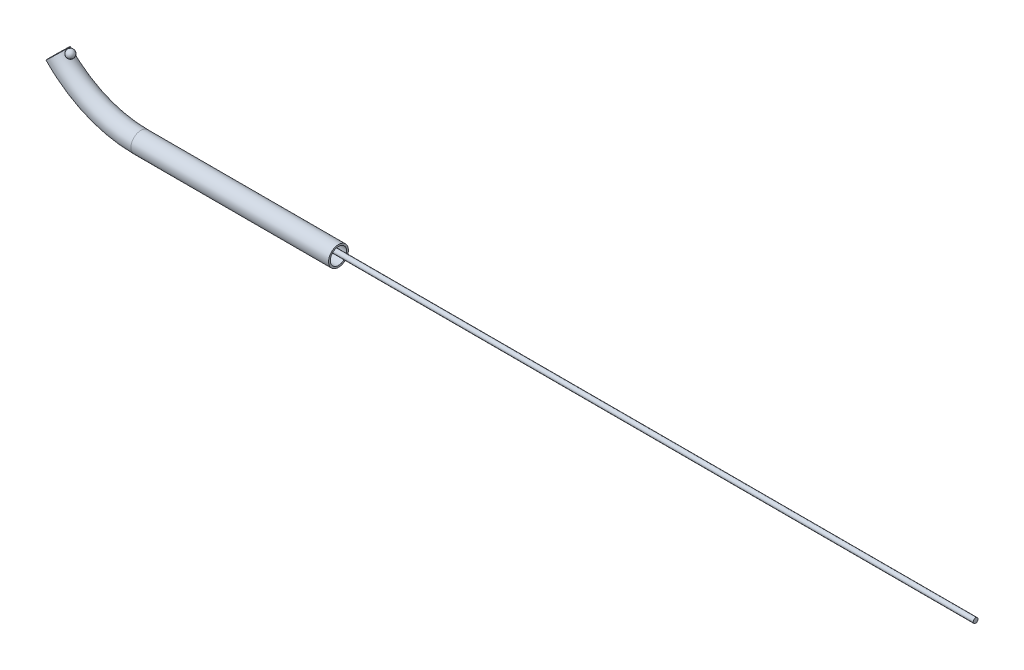
ISO-10303-21;
HEADER;
FILE_DESCRIPTION(('STEP AP214'),'2;1');
FILE_NAME('part.step','',(''),(''),'','','');
FILE_SCHEMA(('AUTOMOTIVE_DESIGN { 1 0 10303 214 1 1 1 1 }'));
ENDSEC;
DATA;
#1=APPLICATION_CONTEXT('core data for automotive mechanical design processes');
#2=APPLICATION_PROTOCOL_DEFINITION('international standard','automotive_design',2000,#1);
#3=PRODUCT_CONTEXT('',#1,'mechanical');
#4=PRODUCT('Part','Part','',(#3));
#5=PRODUCT_RELATED_PRODUCT_CATEGORY('part','',(#4));
#6=PRODUCT_DEFINITION_FORMATION('','',#4);
#7=PRODUCT_DEFINITION_CONTEXT('part definition',#1,'design');
#8=PRODUCT_DEFINITION('design','',#6,#7);
#9=PRODUCT_DEFINITION_SHAPE('','',#8);
#10=(LENGTH_UNIT() NAMED_UNIT(*) SI_UNIT(.MILLI.,.METRE.));
#11=(NAMED_UNIT(*) PLANE_ANGLE_UNIT() SI_UNIT($,.RADIAN.));
#12=(NAMED_UNIT(*) SI_UNIT($,.STERADIAN.) SOLID_ANGLE_UNIT());
#13=UNCERTAINTY_MEASURE_WITH_UNIT(LENGTH_MEASURE(1.E-05),#10,'distance_accuracy_value','');
#14=(GEOMETRIC_REPRESENTATION_CONTEXT(3) GLOBAL_UNCERTAINTY_ASSIGNED_CONTEXT((#13)) GLOBAL_UNIT_ASSIGNED_CONTEXT((#10,
#11,#12)) REPRESENTATION_CONTEXT('',''));
#15=CARTESIAN_POINT('',(0.,0.,0.));
#16=DIRECTION('',(0.,0.,1.));
#17=DIRECTION('',(1.,0.,0.));
#18=AXIS2_PLACEMENT_3D('',#15,#16,#17);
#19=CARTESIAN_POINT('',(-68.3649682129226,0.177699999999989,0.));
#20=DIRECTION('',(1.,0.,0.));
#21=DIRECTION('',(0.,1.,0.));
#22=AXIS2_PLACEMENT_3D('',#19,#20,#21);
#23=CYLINDRICAL_SURFACE('',#22,0.150000000000008);
#24=CARTESIAN_POINT('',(-68.3649682129226,0.177699999999989,0.));
#25=DIRECTION('',(-1.,0.,0.));
#26=DIRECTION('',(0.,-1.,0.));
#27=AXIS2_PLACEMENT_3D('',#24,#25,#26);
#28=CIRCLE('',#27,0.150000000000008);
#29=CARTESIAN_POINT('',(-68.3649682129226,0.0276999999999812,0.));
#30=VERTEX_POINT('',#29);
#31=EDGE_CURVE('E11',#30,#30,#28,.T.);
#32=ORIENTED_EDGE('',*,*,#31,.F.);
#33=EDGE_LOOP('',(#32));
#34=FACE_BOUND('',#33,.T.);
#35=CARTESIAN_POINT('',(-15.9542229508361,0.177700000000038,0.));
#36=DIRECTION('',(1.,0.,0.));
#37=DIRECTION('',(0.,1.,0.));
#38=AXIS2_PLACEMENT_3D('',#35,#36,#37);
#39=CIRCLE('',#38,0.150000000000008);
#40=CARTESIAN_POINT('',(-15.9542229508361,0.327700000000046,0.));
#41=VERTEX_POINT('',#40);
#42=EDGE_CURVE('E49',#41,#41,#39,.T.);
#43=ORIENTED_EDGE('',*,*,#42,.F.);
#44=EDGE_LOOP('',(#43));
#45=FACE_BOUND('',#44,.T.);
#46=ADVANCED_FACE('F39',(#34,#45),#23,.T.);
#47=CARTESIAN_POINT('',(-68.3649682129226,7.15322745789866,0.));
#48=DIRECTION('',(0.,0.,-1.));
#49=DIRECTION('',(-1.,0.,0.));
#50=AXIS2_PLACEMENT_3D('',#47,#48,#49);
#51=TOROIDAL_SURFACE('',#50,6.97552745789867,0.150000000000008);
#52=CARTESIAN_POINT('',(-73.4211282675444,2.34768598810101,0.));
#53=DIRECTION('',(-0.688914422429251,0.724842685393853,0.));
#54=DIRECTION('',(-0.724842685393853,-0.688914422429251,0.));
#55=AXIS2_PLACEMENT_3D('',#52,#53,#54);
#56=CIRCLE('',#55,0.150000000000008);
#57=CARTESIAN_POINT('',(-73.5298546703535,2.24434882473662,0.));
#58=VERTEX_POINT('',#57);
#59=EDGE_CURVE('E45',#58,#58,#56,.T.);
#60=CARTESIAN_POINT('',(-68.3649682129226,7.15322745789866,0.));
#61=DIRECTION('',(0.,0.,-1.));
#62=DIRECTION('',(-1.,0.,0.));
#63=AXIS2_PLACEMENT_3D('',#60,#61,#62);
#64=CIRCLE('',#63,7.12552745789868);
#65=EDGE_CURVE('',#30,#58,#64,.T.);
#66=ORIENTED_EDGE('',*,*,#31,.T.);
#67=ORIENTED_EDGE('',*,*,#59,.F.);
#68=ORIENTED_EDGE('',*,*,#65,.T.);
#69=ORIENTED_EDGE('',*,*,#65,.F.);
#70=EDGE_LOOP('',(#66,#68,#67,#69));
#71=FACE_BOUND('',#70,.T.);
#72=ADVANCED_FACE('F59',(#71),#51,.T.);
#73=CARTESIAN_POINT('',(-73.4211282675444,2.34768598810101,0.));
#74=DIRECTION('',(-0.688914422429251,0.724842685393853,0.));
#75=DIRECTION('',(-0.724842685393853,-0.688914422429251,0.));
#76=AXIS2_PLACEMENT_3D('',#73,#74,#75);
#77=PLANE('',#76);
#78=ORIENTED_EDGE('',*,*,#59,.T.);
#79=EDGE_LOOP('',(#78));
#80=FACE_BOUND('',#79,.T.);
#81=ADVANCED_FACE('F64',(#80),#77,.T.);
#82=CARTESIAN_POINT('',(-15.9542229508361,0.177700000000038,0.));
#83=DIRECTION('',(1.,0.,0.));
#84=DIRECTION('',(0.,1.,0.));
#85=AXIS2_PLACEMENT_3D('',#82,#83,#84);
#86=PLANE('',#85);
#87=ORIENTED_EDGE('',*,*,#42,.T.);
#88=EDGE_LOOP('',(#87));
#89=FACE_BOUND('',#88,.T.);
#90=ADVANCED_FACE('F56',(#89),#86,.T.);
#91=CLOSED_SHELL('',(#46,#72,#81,#90));
#92=MANIFOLD_SOLID_BREP('B2',#91);
#93=CARTESIAN_POINT('',(-68.3649682129226,7.15322745789866,0.));
#94=DIRECTION('',(0.,0.,-1.));
#95=DIRECTION('',(-1.,0.,0.));
#96=AXIS2_PLACEMENT_3D('',#93,#94,#95);
#97=TOROIDAL_SURFACE('',#96,7.15322745789866,0.6223);
#98=CARTESIAN_POINT('',(-72.9296125399738,2.45231556693282,-0.162231624588265));
#99=CARTESIAN_POINT('',(-72.9215501748899,2.44420333768813,-0.162985915621017));
#100=CARTESIAN_POINT('',(-72.9132495705184,2.43623847207314,-0.162846709843409));
#101=CARTESIAN_POINT('',(-72.8963949861295,2.42081537807001,-0.160778709201735));
#102=CARTESIAN_POINT('',(-72.8878408277221,2.41335751915316,-0.158848623959505));
#103=CARTESIAN_POINT('',(-72.8707373660263,2.39911414014025,-0.153191778621824));
#104=CARTESIAN_POINT('',(-72.8621880917451,2.39232970055476,-0.149462185634209));
#105=CARTESIAN_POINT('',(-72.8454360430442,2.37959646254954,-0.140212048773996));
#106=CARTESIAN_POINT('',(-72.8372332315845,2.37364757464263,-0.134691696900749));
#107=CARTESIAN_POINT('',(-72.8218060884418,2.36288393777016,-0.122093918042157));
#108=CARTESIAN_POINT('',(-72.8145597209712,2.35804041634906,-0.115068420488231));
#109=CARTESIAN_POINT('',(-72.8011924504897,2.34938409272325,-0.0994744633301903));
#110=CARTESIAN_POINT('',(-72.7950704932524,2.34557032344803,-0.0909074640869792));
#111=CARTESIAN_POINT('',(-72.7850736501799,2.33948792826428,-0.0736061865020022));
#112=CARTESIAN_POINT('',(-72.781013716827,2.33708589881384,-0.0650260965331795));
#113=CARTESIAN_POINT('',(-72.7743973684886,2.33322303008166,-0.0471086922633796));
#114=CARTESIAN_POINT('',(-72.7718391225746,2.33176104444553,-0.0377723159424036));
#115=CARTESIAN_POINT('',(-72.7686653842543,2.32995580921218,-0.0199973692769874));
#116=CARTESIAN_POINT('',(-72.7678327334275,2.32948730131519,-0.011609727470488));
#117=CARTESIAN_POINT('',(-72.7674973160465,2.32929803884335,0.00519934363481592));
#118=CARTESIAN_POINT('',(-72.7679940046332,2.32957697791094,0.0136207576785419));
#119=CARTESIAN_POINT('',(-72.7702102738688,2.33083351394292,0.0297025399185543));
#120=CARTESIAN_POINT('',(-72.7718512653795,2.33176623062762,0.0373775275720592));
#121=CARTESIAN_POINT('',(-72.7761766208485,2.3342596299772,0.0523186782891281));
#122=CARTESIAN_POINT('',(-72.7788610594966,2.33582035759531,0.0595848120443553));
#123=CARTESIAN_POINT('',(-72.7852512080412,2.33960631113679,0.0738019379896634));
#124=CARTESIAN_POINT('',(-72.7889905542734,2.34185366946152,0.0807318124321275));
#125=CARTESIAN_POINT('',(-72.7972669139487,2.34694798104276,0.0938534271152317));
#126=CARTESIAN_POINT('',(-72.8018042151244,2.34979515065723,0.100044899741415));
#127=CARTESIAN_POINT('',(-72.8120123433624,2.35637787321964,0.112221774400418));
#128=CARTESIAN_POINT('',(-72.8177523902374,2.36017568266087,0.118115344466518));
#129=CARTESIAN_POINT('',(-72.8297598410948,2.36839028741973,0.128835206562353));
#130=CARTESIAN_POINT('',(-72.8360274999649,2.37280738260601,0.133660978610083));
#131=CARTESIAN_POINT('',(-72.8497219337649,2.38280836253562,0.142770664884137));
#132=CARTESIAN_POINT('',(-72.8571935263533,2.38846927876268,0.146902796180538));
#133=CARTESIAN_POINT('',(-72.8722952549711,2.40040312787,0.153749912437162));
#134=CARTESIAN_POINT('',(-72.8799254653304,2.40667635301531,0.15646421668056));
#135=CARTESIAN_POINT('',(-72.8959291893155,2.42041080660626,0.160682718197196));
#136=CARTESIAN_POINT('',(-72.904296668265,2.42792761933674,0.162030015164965));
#137=CARTESIAN_POINT('',(-72.9207220427379,2.44340003977206,0.162990307676196));
#138=CARTESIAN_POINT('',(-72.9287798287983,2.45135580024961,0.162602695587667));
#139=CARTESIAN_POINT('',(-72.9447498127938,2.46787340554959,0.160032545070037));
#140=CARTESIAN_POINT('',(-72.952637563331,2.47644619234303,0.157766881614251));
#141=CARTESIAN_POINT('',(-72.9676574964394,2.49354628269152,0.151331048323228));
#142=CARTESIAN_POINT('',(-72.9747895849688,2.50207358046036,0.147160641785323));
#143=CARTESIAN_POINT('',(-72.9879595528189,2.51850933164872,0.137056287312086));
#144=CARTESIAN_POINT('',(-72.9940202797939,2.5264279135323,0.131168900787446));
#145=CARTESIAN_POINT('',(-73.0051104088774,2.54146259807317,0.117646424643872));
#146=CARTESIAN_POINT('',(-73.0101404599229,2.54857920439425,0.110012441171333));
#147=CARTESIAN_POINT('',(-73.0185749559031,2.56087620567489,0.0939956681869445));
#148=CARTESIAN_POINT('',(-73.0220926435068,2.56617986143605,0.0857677752173634));
#149=CARTESIAN_POINT('',(-73.0280775781637,2.57538568676014,0.0682183020941197));
#150=CARTESIAN_POINT('',(-73.0305462382761,2.57928974049664,0.0588982148881641));
#151=CARTESIAN_POINT('',(-73.0340767537525,2.58493685065564,0.0408849101830477));
#152=CARTESIAN_POINT('',(-73.0352893555977,2.58690917771996,0.0322927969828676));
#153=CARTESIAN_POINT('',(-73.03684537088,2.58944738088496,0.0148277251516942));
#154=CARTESIAN_POINT('',(-73.0371894040806,2.5900142598322,0.00595497135065177));
#155=CARTESIAN_POINT('',(-73.0370079156127,2.58971678700277,-0.0108743191841573));
#156=CARTESIAN_POINT('',(-73.0365650701557,2.58898850879263,-0.0188346392271665));
#157=CARTESIAN_POINT('',(-73.0349783886321,2.586404234979,-0.0344965034716511));
#158=CARTESIAN_POINT('',(-73.0338346091183,2.58454833035469,-0.0421980684971065));
#159=CARTESIAN_POINT('',(-73.030875745764,2.5798180665763,-0.057134396606846));
#160=CARTESIAN_POINT('',(-73.0290612748371,2.57694463739067,-0.0643695788290028));
#161=CARTESIAN_POINT('',(-73.024800243945,2.57032654058017,-0.0782271610208334));
#162=CARTESIAN_POINT('',(-73.0223535271467,2.56658165680752,-0.0848494083931327));
#163=CARTESIAN_POINT('',(-73.0166424786211,2.55804123795011,-0.0978968045459019));
#164=CARTESIAN_POINT('',(-73.0133267953118,2.55318393847707,-0.10425887638866));
#165=CARTESIAN_POINT('',(-73.0060644690918,2.54284792182489,-0.116048600807803));
#166=CARTESIAN_POINT('',(-73.0021174795615,2.5373688637512,-0.121475736636416));
#167=CARTESIAN_POINT('',(-72.9931158802613,2.52526180564205,-0.13197261554992));
#168=CARTESIAN_POINT('',(-72.9879842877483,2.51857620694077,-0.136909828851794));
#169=CARTESIAN_POINT('',(-72.9770866273557,2.50491070439849,-0.145502938981017));
#170=CARTESIAN_POINT('',(-72.9713205301259,2.49793078695248,-0.149158776503325));
#171=CARTESIAN_POINT('',(-72.9597410586429,2.48445892215581,-0.154934806732401));
#172=CARTESIAN_POINT('',(-72.9539698605184,2.4779735828661,-0.157155893578039));
#173=CARTESIAN_POINT('',(-72.942051704856,2.46506742440212,-0.160510070361542));
#174=CARTESIAN_POINT('',(-72.9359046752808,2.4586466178735,-0.161642951017979));
#175=CARTESIAN_POINT('',(-72.9296125399738,2.45231556693282,-0.162231624588265));
#176=B_SPLINE_CURVE_WITH_KNOTS('',3,(#98,#99,#100,#101,#102,#103,#104,#105,#106,#107,#108,#109,
#110,#111,#112,#113,#114,#115,#116,#117,#118,#119,#120,#121,#122,#123,#124,#125,#126,#127,#128,
#129,#130,#131,#132,#133,#134,#135,#136,#137,#138,#139,#140,#141,#142,#143,#144,#145,#146,#147,
#148,#149,#150,#151,#152,#153,#154,#155,#156,#157,#158,#159,#160,#161,#162,#163,#164,#165,#166,
#167,#168,#169,#170,#171,#172,#173,#174,#175),.UNSPECIFIED.,.T.,.F.,(4,2,2,2,2,2,2,2,2,2,2,2,2,
2,2,2,2,2,2,2,2,2,2,2,2,2,2,2,2,2,2,2,2,2,2,2,2,2,4),(0.,0.0343562064778077,0.0687371867909832,
0.103172469163847,0.13760406071719,0.170998168480232,0.204360804906564,0.23356151259637,
0.262726543049339,0.287919015904831,0.313101164651425,0.336705153351786,0.360310831933616,
0.384776295661251,0.409250599483896,0.436325958133949,0.46341447270434,0.494021264414464,
0.524642737359924,0.558477983235079,0.592325080443995,0.62775567208611,0.6631906678909,
0.697742190245707,0.732271890872163,0.763293139778437,0.794272469004267,0.820819320597968,
0.847347224433725,0.871250118652053,0.895151084592733,0.919030262342344,0.942915369193818,
0.968803066440357,0.99470502646684,1.02389066160519,1.05307764734407,1.07988520812325,
1.10669792344214),.UNSPECIFIED.);
#177=CARTESIAN_POINT('',(-72.9296125399738,2.45231556693282,-0.162231624588265));
#178=VERTEX_POINT('',#177);
#179=EDGE_CURVE('E102',#178,#178,#176,.T.);
#180=ORIENTED_EDGE('',*,*,#179,.T.);
#181=EDGE_LOOP('',(#180));
#182=FACE_BOUND('',#181,.T.);
#183=CARTESIAN_POINT('',(-68.3649682129226,0.,0.));
#184=DIRECTION('',(1.,0.,0.));
#185=DIRECTION('',(0.,0.,-1.));
#186=AXIS2_PLACEMENT_3D('',#183,#184,#185);
#187=CIRCLE('',#186,0.6223);
#188=CARTESIAN_POINT('',(-68.3649682129226,0.,-0.6223));
#189=VERTEX_POINT('',#188);
#190=EDGE_CURVE('E113',#189,#189,#187,.T.);
#191=ORIENTED_EDGE('',*,*,#190,.F.);
#192=EDGE_LOOP('',(#191));
#193=FACE_BOUND('',#192,.T.);
#194=CARTESIAN_POINT('',(-73.5499328127389,2.22526589523535,0.));
#195=DIRECTION('',(0.688914422429251,-0.724842685393853,0.));
#196=DIRECTION('',(0.,0.,-1.));
#197=AXIS2_PLACEMENT_3D('',#194,#195,#196);
#198=CIRCLE('',#197,0.6223);
#199=CARTESIAN_POINT('',(-73.5499328127389,2.22526589523535,-0.6223));
#200=VERTEX_POINT('',#199);
#201=EDGE_CURVE('E38',#200,#200,#198,.T.);
#202=ORIENTED_EDGE('',*,*,#201,.T.);
#203=EDGE_LOOP('',(#202));
#204=FACE_BOUND('',#203,.T.);
#205=ADVANCED_FACE('F98',(#182,#193,#204),#97,.T.);
#206=CARTESIAN_POINT('',(-68.3649682129226,7.15322745789866,0.));
#207=DIRECTION('',(0.,0.,-1.));
#208=DIRECTION('',(-1.,0.,0.));
#209=AXIS2_PLACEMENT_3D('',#206,#207,#208);
#210=TOROIDAL_SURFACE('',#209,7.15322745789866,0.51435);
#211=CARTESIAN_POINT('',(-68.3649682129226,0.,0.));
#212=DIRECTION('',(1.,0.,0.));
#213=DIRECTION('',(0.,0.,-1.));
#214=AXIS2_PLACEMENT_3D('',#211,#212,#213);
#215=CIRCLE('',#214,0.51435);
#216=CARTESIAN_POINT('',(-68.3649682129226,-0.51435,0.));
#217=VERTEX_POINT('',#216);
#218=EDGE_CURVE('E118',#217,#217,#215,.T.);
#219=CARTESIAN_POINT('',(-73.5499328127389,2.22526589523535,0.));
#220=DIRECTION('',(0.688914422429251,-0.724842685393853,0.));
#221=DIRECTION('',(0.,0.,-1.));
#222=AXIS2_PLACEMENT_3D('',#219,#220,#221);
#223=CIRCLE('',#222,0.51435);
#224=CARTESIAN_POINT('',(-73.9227556479712,1.87092276205886,0.));
#225=VERTEX_POINT('',#224);
#226=EDGE_CURVE('E109',#225,#225,#223,.T.);
#227=CARTESIAN_POINT('',(-68.3649682129226,7.15322745789866,0.));
#228=DIRECTION('',(0.,0.,-1.));
#229=DIRECTION('',(-1.,0.,0.));
#230=AXIS2_PLACEMENT_3D('',#227,#228,#229);
#231=CIRCLE('',#230,7.66757745789866);
#232=EDGE_CURVE('',#217,#225,#231,.T.);
#233=ORIENTED_EDGE('',*,*,#218,.T.);
#234=ORIENTED_EDGE('',*,*,#226,.F.);
#235=ORIENTED_EDGE('',*,*,#232,.T.);
#236=ORIENTED_EDGE('',*,*,#232,.F.);
#237=EDGE_LOOP('',(#233,#235,#234,#236));
#238=FACE_BOUND('',#237,.T.);
#239=ADVANCED_FACE('F144',(#238),#210,.F.);
#240=CARTESIAN_POINT('',(-68.3649682129226,0.,0.));
#241=DIRECTION('',(1.,0.,0.));
#242=DIRECTION('',(0.,0.,-1.));
#243=AXIS2_PLACEMENT_3D('',#240,#241,#242);
#244=CYLINDRICAL_SURFACE('',#243,0.51435);
#245=ORIENTED_EDGE('',*,*,#218,.F.);
#246=EDGE_LOOP('',(#245));
#247=FACE_BOUND('',#246,.T.);
#248=CARTESIAN_POINT('',(-55.9542229508361,0.,0.));
#249=DIRECTION('',(1.,0.,0.));
#250=DIRECTION('',(0.,0.,-1.));
#251=AXIS2_PLACEMENT_3D('',#248,#249,#250);
#252=CIRCLE('',#251,0.51435);
#253=CARTESIAN_POINT('',(-55.9542229508361,0.,-0.51435));
#254=VERTEX_POINT('',#253);
#255=EDGE_CURVE('E124',#254,#254,#252,.T.);
#256=ORIENTED_EDGE('',*,*,#255,.T.);
#257=EDGE_LOOP('',(#256));
#258=FACE_BOUND('',#257,.T.);
#259=ADVANCED_FACE('F148',(#247,#258),#244,.F.);
#260=CARTESIAN_POINT('',(-68.3649682129226,0.,0.));
#261=DIRECTION('',(1.,0.,0.));
#262=DIRECTION('',(0.,0.,-1.));
#263=AXIS2_PLACEMENT_3D('',#260,#261,#262);
#264=CYLINDRICAL_SURFACE('',#263,0.6223);
#265=ORIENTED_EDGE('',*,*,#190,.T.);
#266=EDGE_LOOP('',(#265));
#267=FACE_BOUND('',#266,.T.);
#268=CARTESIAN_POINT('',(-55.9542229508361,0.,0.));
#269=DIRECTION('',(1.,0.,0.));
#270=DIRECTION('',(0.,0.,-1.));
#271=AXIS2_PLACEMENT_3D('',#268,#269,#270);
#272=CIRCLE('',#271,0.6223);
#273=CARTESIAN_POINT('',(-55.9542229508361,0.,-0.6223));
#274=VERTEX_POINT('',#273);
#275=EDGE_CURVE('E121',#274,#274,#272,.T.);
#276=ORIENTED_EDGE('',*,*,#275,.F.);
#277=EDGE_LOOP('',(#276));
#278=FACE_BOUND('',#277,.T.);
#279=ADVANCED_FACE('F153',(#267,#278),#264,.T.);
#280=CARTESIAN_POINT('',(-73.5499328127389,2.22526589523535,0.));
#281=DIRECTION('',(0.688914422429251,-0.724842685393853,0.));
#282=DIRECTION('',(0.,0.,-1.));
#283=AXIS2_PLACEMENT_3D('',#280,#281,#282);
#284=PLANE('',#283);
#285=ORIENTED_EDGE('',*,*,#226,.T.);
#286=EDGE_LOOP('',(#285));
#287=FACE_BOUND('',#286,.T.);
#288=ORIENTED_EDGE('',*,*,#201,.F.);
#289=EDGE_LOOP('',(#288));
#290=FACE_BOUND('',#289,.T.);
#291=ADVANCED_FACE('F139',(#287,#290),#284,.F.);
#292=CARTESIAN_POINT('',(-55.9542229508361,0.,0.));
#293=DIRECTION('',(1.,0.,0.));
#294=DIRECTION('',(0.,0.,-1.));
#295=AXIS2_PLACEMENT_3D('',#292,#293,#294);
#296=PLANE('',#295);
#297=ORIENTED_EDGE('',*,*,#275,.T.);
#298=EDGE_LOOP('',(#297));
#299=FACE_BOUND('',#298,.T.);
#300=ORIENTED_EDGE('',*,*,#255,.F.);
#301=EDGE_LOOP('',(#300));
#302=FACE_BOUND('',#301,.T.);
#303=ADVANCED_FACE('F135',(#299,#302),#296,.T.);
#304=CARTESIAN_POINT('',(-72.7873645897432,2.57859470474387,0.));
#305=DIRECTION('',(-0.646795710542048,-0.762663299775469,0.));
#306=DIRECTION('',(0.762663299775469,-0.646795710542048,0.));
#307=AXIS2_PLACEMENT_3D('',#304,#305,#306);
#308=SPHERICAL_SURFACE('',#307,0.25);
#309=ORIENTED_EDGE('',*,*,#179,.F.);
#310=EDGE_LOOP('',(#309));
#311=FACE_BOUND('',#310,.T.);
#312=ADVANCED_FACE('F133',(#311),#308,.T.);
#313=CLOSED_SHELL('',(#205,#239,#259,#279,#291,#303,#312));
#314=MANIFOLD_SOLID_BREP('B6',#313);
#315=ADVANCED_BREP_SHAPE_REPRESENTATION('',(#18,#92,#314),#14);
#316=SHAPE_DEFINITION_REPRESENTATION(#9,#315);
ENDSEC;
END-ISO-10303-21;
